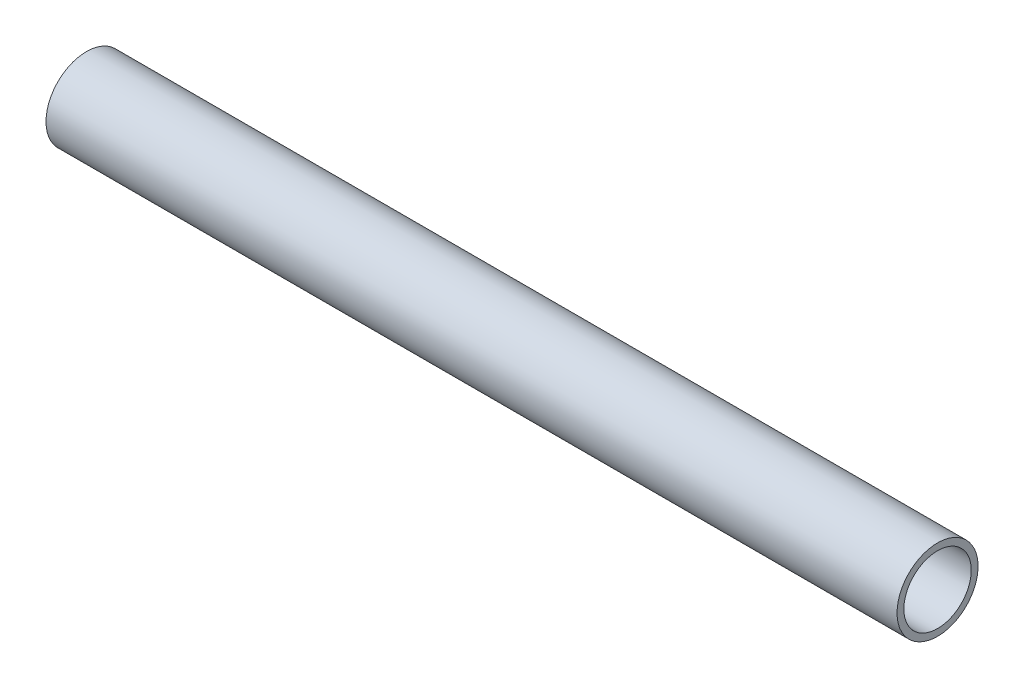
ISO-10303-21;
HEADER;
FILE_DESCRIPTION(('STEP AP214'),'2;1');
FILE_NAME('part.step','',(''),(''),'','','');
FILE_SCHEMA(('AUTOMOTIVE_DESIGN { 1 0 10303 214 1 1 1 1 }'));
ENDSEC;
DATA;
#1=APPLICATION_CONTEXT('core data for automotive mechanical design processes');
#2=APPLICATION_PROTOCOL_DEFINITION('international standard','automotive_design',2000,#1);
#3=PRODUCT_CONTEXT('',#1,'mechanical');
#4=PRODUCT('Part','Part','',(#3));
#5=PRODUCT_RELATED_PRODUCT_CATEGORY('part','',(#4));
#6=PRODUCT_DEFINITION_FORMATION('','',#4);
#7=PRODUCT_DEFINITION_CONTEXT('part definition',#1,'design');
#8=PRODUCT_DEFINITION('design','',#6,#7);
#9=PRODUCT_DEFINITION_SHAPE('','',#8);
#10=(LENGTH_UNIT() NAMED_UNIT(*) SI_UNIT(.MILLI.,.METRE.));
#11=(NAMED_UNIT(*) PLANE_ANGLE_UNIT() SI_UNIT($,.RADIAN.));
#12=(NAMED_UNIT(*) SI_UNIT($,.STERADIAN.) SOLID_ANGLE_UNIT());
#13=UNCERTAINTY_MEASURE_WITH_UNIT(LENGTH_MEASURE(1.E-05),#10,'distance_accuracy_value','');
#14=(GEOMETRIC_REPRESENTATION_CONTEXT(3) GLOBAL_UNCERTAINTY_ASSIGNED_CONTEXT((#13)) GLOBAL_UNIT_ASSIGNED_CONTEXT((#10,
#11,#12)) REPRESENTATION_CONTEXT('',''));
#15=CARTESIAN_POINT('',(0.,0.,0.));
#16=DIRECTION('',(0.,0.,1.));
#17=DIRECTION('',(1.,0.,0.));
#18=AXIS2_PLACEMENT_3D('',#15,#16,#17);
#19=CARTESIAN_POINT('',(25.2027542670464,670.528863505979,0.));
#20=DIRECTION('',(1.,0.,0.));
#21=DIRECTION('',(0.,0.,-1.));
#22=AXIS2_PLACEMENT_3D('',#19,#20,#21);
#23=CYLINDRICAL_SURFACE('',#22,5.28320000000004);
#24=CARTESIAN_POINT('',(25.2027542670464,670.528863505979,0.));
#25=DIRECTION('',(-1.,0.,0.));
#26=DIRECTION('',(0.,0.,1.));
#27=AXIS2_PLACEMENT_3D('',#24,#25,#26);
#28=CIRCLE('',#27,5.28320000000004);
#29=CARTESIAN_POINT('',(25.2027542670464,670.528863505979,5.28320000000004));
#30=VERTEX_POINT('',#29);
#31=EDGE_CURVE('E45',#30,#30,#28,.T.);
#32=ORIENTED_EDGE('',*,*,#31,.T.);
#33=EDGE_LOOP('',(#32));
#34=FACE_BOUND('',#33,.T.);
#35=CARTESIAN_POINT('',(158.567849636995,670.528863505979,0.));
#36=DIRECTION('',(-1.,0.,0.));
#37=DIRECTION('',(0.,0.,1.));
#38=AXIS2_PLACEMENT_3D('',#35,#36,#37);
#39=CIRCLE('',#38,5.28320000000004);
#40=CARTESIAN_POINT('',(158.567849636995,670.528863505979,5.28320000000004));
#41=VERTEX_POINT('',#40);
#42=EDGE_CURVE('E51',#41,#41,#39,.T.);
#43=ORIENTED_EDGE('',*,*,#42,.F.);
#44=EDGE_LOOP('',(#43));
#45=FACE_BOUND('',#44,.T.);
#46=ADVANCED_FACE('F38',(#34,#45),#23,.F.);
#47=CARTESIAN_POINT('',(25.2027542670464,670.528863505979,0.));
#48=DIRECTION('',(1.,0.,0.));
#49=DIRECTION('',(0.,0.,-1.));
#50=AXIS2_PLACEMENT_3D('',#47,#48,#49);
#51=CYLINDRICAL_SURFACE('',#50,6.35000000000005);
#52=CARTESIAN_POINT('',(25.2027542670464,670.528863505979,0.));
#53=DIRECTION('',(-1.,0.,0.));
#54=DIRECTION('',(0.,0.,1.));
#55=AXIS2_PLACEMENT_3D('',#52,#53,#54);
#56=CIRCLE('',#55,6.35000000000005);
#57=CARTESIAN_POINT('',(25.2027542670464,670.528863505979,6.35000000000005));
#58=VERTEX_POINT('',#57);
#59=EDGE_CURVE('E11',#58,#58,#56,.T.);
#60=ORIENTED_EDGE('',*,*,#59,.F.);
#61=EDGE_LOOP('',(#60));
#62=FACE_BOUND('',#61,.T.);
#63=CARTESIAN_POINT('',(158.567849636995,670.528863505979,0.));
#64=DIRECTION('',(-1.,0.,0.));
#65=DIRECTION('',(0.,0.,1.));
#66=AXIS2_PLACEMENT_3D('',#63,#64,#65);
#67=CIRCLE('',#66,6.35000000000005);
#68=CARTESIAN_POINT('',(158.567849636995,670.528863505979,6.35000000000005));
#69=VERTEX_POINT('',#68);
#70=EDGE_CURVE('E41',#69,#69,#67,.T.);
#71=ORIENTED_EDGE('',*,*,#70,.T.);
#72=EDGE_LOOP('',(#71));
#73=FACE_BOUND('',#72,.T.);
#74=ADVANCED_FACE('F58',(#62,#73),#51,.T.);
#75=CARTESIAN_POINT('',(25.2027542670464,670.528863505979,0.));
#76=DIRECTION('',(-1.,0.,0.));
#77=DIRECTION('',(0.,0.,1.));
#78=AXIS2_PLACEMENT_3D('',#75,#76,#77);
#79=PLANE('',#78);
#80=ORIENTED_EDGE('',*,*,#31,.F.);
#81=EDGE_LOOP('',(#80));
#82=FACE_BOUND('',#81,.T.);
#83=ORIENTED_EDGE('',*,*,#59,.T.);
#84=EDGE_LOOP('',(#83));
#85=FACE_BOUND('',#84,.T.);
#86=ADVANCED_FACE('F62',(#82,#85),#79,.T.);
#87=CARTESIAN_POINT('',(158.567849636995,670.528863505979,0.));
#88=DIRECTION('',(-1.,0.,0.));
#89=DIRECTION('',(0.,0.,1.));
#90=AXIS2_PLACEMENT_3D('',#87,#88,#89);
#91=PLANE('',#90);
#92=ORIENTED_EDGE('',*,*,#42,.T.);
#93=EDGE_LOOP('',(#92));
#94=FACE_BOUND('',#93,.T.);
#95=ORIENTED_EDGE('',*,*,#70,.F.);
#96=EDGE_LOOP('',(#95));
#97=FACE_BOUND('',#96,.T.);
#98=ADVANCED_FACE('F60',(#94,#97),#91,.F.);
#99=CLOSED_SHELL('',(#46,#74,#86,#98));
#100=MANIFOLD_SOLID_BREP('B2',#99);
#101=ADVANCED_BREP_SHAPE_REPRESENTATION('',(#18,#100),#14);
#102=SHAPE_DEFINITION_REPRESENTATION(#9,#101);
ENDSEC;
END-ISO-10303-21;
